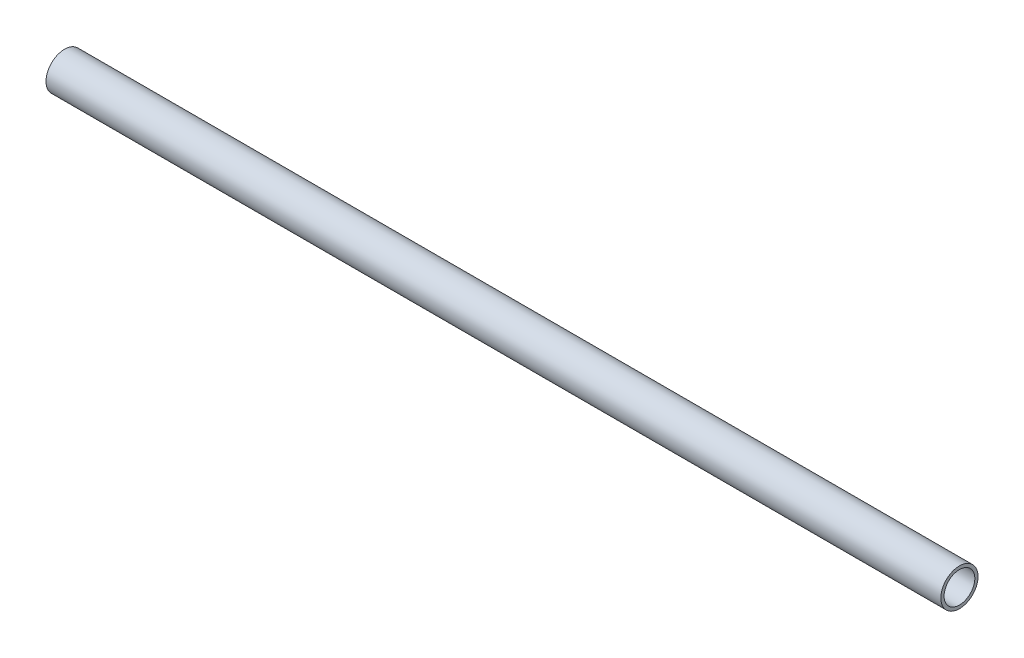
ISO-10303-21;
HEADER;
FILE_DESCRIPTION(('STEP AP214'),'2;1');
FILE_NAME('part.step','',(''),(''),'','','');
FILE_SCHEMA(('AUTOMOTIVE_DESIGN { 1 0 10303 214 1 1 1 1 }'));
ENDSEC;
DATA;
#1=APPLICATION_CONTEXT('core data for automotive mechanical design processes');
#2=APPLICATION_PROTOCOL_DEFINITION('international standard','automotive_design',2000,#1);
#3=PRODUCT_CONTEXT('',#1,'mechanical');
#4=PRODUCT('Part','Part','',(#3));
#5=PRODUCT_RELATED_PRODUCT_CATEGORY('part','',(#4));
#6=PRODUCT_DEFINITION_FORMATION('','',#4);
#7=PRODUCT_DEFINITION_CONTEXT('part definition',#1,'design');
#8=PRODUCT_DEFINITION('design','',#6,#7);
#9=PRODUCT_DEFINITION_SHAPE('','',#8);
#10=(LENGTH_UNIT() NAMED_UNIT(*) SI_UNIT(.MILLI.,.METRE.));
#11=(NAMED_UNIT(*) PLANE_ANGLE_UNIT() SI_UNIT($,.RADIAN.));
#12=(NAMED_UNIT(*) SI_UNIT($,.STERADIAN.) SOLID_ANGLE_UNIT());
#13=UNCERTAINTY_MEASURE_WITH_UNIT(LENGTH_MEASURE(1.E-05),#10,'distance_accuracy_value','');
#14=(GEOMETRIC_REPRESENTATION_CONTEXT(3) GLOBAL_UNCERTAINTY_ASSIGNED_CONTEXT((#13)) GLOBAL_UNIT_ASSIGNED_CONTEXT((#10,
#11,#12)) REPRESENTATION_CONTEXT('',''));
#15=CARTESIAN_POINT('',(0.,0.,0.));
#16=DIRECTION('',(0.,0.,1.));
#17=DIRECTION('',(1.,0.,0.));
#18=AXIS2_PLACEMENT_3D('',#15,#16,#17);
#19=CARTESIAN_POINT('',(228.600000000005,0.,0.));
#20=DIRECTION('',(1.,0.,0.));
#21=DIRECTION('',(0.,0.,-1.));
#22=AXIS2_PLACEMENT_3D('',#19,#20,#21);
#23=PLANE('',#22);
#24=CARTESIAN_POINT('',(228.600000000005,0.,0.));
#25=DIRECTION('',(-1.,0.,0.));
#26=DIRECTION('',(0.,0.,1.));
#27=AXIS2_PLACEMENT_3D('',#24,#25,#26);
#28=CIRCLE('',#27,7.84480177551919);
#29=CARTESIAN_POINT('',(228.600000000005,0.,7.84480177551919));
#30=VERTEX_POINT('',#29);
#31=EDGE_CURVE('E10',#30,#30,#28,.T.);
#32=ORIENTED_EDGE('',*,*,#31,.T.);
#33=EDGE_LOOP('',(#32));
#34=FACE_BOUND('',#33,.T.);
#35=CARTESIAN_POINT('',(228.600000000005,0.,0.));
#36=DIRECTION('',(-1.,0.,0.));
#37=DIRECTION('',(0.,0.,1.));
#38=AXIS2_PLACEMENT_3D('',#35,#36,#37);
#39=CIRCLE('',#38,9.49580177551919);
#40=CARTESIAN_POINT('',(228.600000000005,0.,9.49580177551919));
#41=VERTEX_POINT('',#40);
#42=EDGE_CURVE('E45',#41,#41,#39,.T.);
#43=ORIENTED_EDGE('',*,*,#42,.F.);
#44=EDGE_LOOP('',(#43));
#45=FACE_BOUND('',#44,.T.);
#46=ADVANCED_FACE('F31',(#34,#45),#23,.T.);
#47=CARTESIAN_POINT('',(-228.6,0.,0.));
#48=DIRECTION('',(-1.,0.,0.));
#49=DIRECTION('',(0.,0.,1.));
#50=AXIS2_PLACEMENT_3D('',#47,#48,#49);
#51=CYLINDRICAL_SURFACE('',#50,7.84480177551919);
#52=CARTESIAN_POINT('',(-228.599999999995,0.,0.));
#53=DIRECTION('',(-1.,0.,0.));
#54=DIRECTION('',(0.,0.,1.));
#55=AXIS2_PLACEMENT_3D('',#52,#53,#54);
#56=CIRCLE('',#55,7.84480177551919);
#57=CARTESIAN_POINT('',(-228.599999999995,0.,7.84480177551919));
#58=VERTEX_POINT('',#57);
#59=EDGE_CURVE('E37',#58,#58,#56,.T.);
#60=ORIENTED_EDGE('',*,*,#59,.T.);
#61=EDGE_LOOP('',(#60));
#62=FACE_BOUND('',#61,.T.);
#63=ORIENTED_EDGE('',*,*,#31,.F.);
#64=EDGE_LOOP('',(#63));
#65=FACE_BOUND('',#64,.T.);
#66=ADVANCED_FACE('F54',(#62,#65),#51,.F.);
#67=CARTESIAN_POINT('',(-228.599999999995,0.,1.33636416086323E-12));
#68=DIRECTION('',(1.,0.,0.));
#69=DIRECTION('',(0.,0.,-1.));
#70=AXIS2_PLACEMENT_3D('',#67,#68,#69);
#71=PLANE('',#70);
#72=ORIENTED_EDGE('',*,*,#59,.F.);
#73=EDGE_LOOP('',(#72));
#74=FACE_BOUND('',#73,.T.);
#75=CARTESIAN_POINT('',(-228.599999999995,0.,0.));
#76=DIRECTION('',(-1.,0.,0.));
#77=DIRECTION('',(0.,0.,1.));
#78=AXIS2_PLACEMENT_3D('',#75,#76,#77);
#79=CIRCLE('',#78,9.49580177551919);
#80=CARTESIAN_POINT('',(-228.599999999995,0.,9.49580177551919));
#81=VERTEX_POINT('',#80);
#82=EDGE_CURVE('E41',#81,#81,#79,.T.);
#83=ORIENTED_EDGE('',*,*,#82,.T.);
#84=EDGE_LOOP('',(#83));
#85=FACE_BOUND('',#84,.T.);
#86=ADVANCED_FACE('F58',(#74,#85),#71,.F.);
#87=CARTESIAN_POINT('',(-228.6,0.,0.));
#88=DIRECTION('',(-1.,0.,0.));
#89=DIRECTION('',(0.,0.,1.));
#90=AXIS2_PLACEMENT_3D('',#87,#88,#89);
#91=CYLINDRICAL_SURFACE('',#90,9.49580177551919);
#92=ORIENTED_EDGE('',*,*,#82,.F.);
#93=EDGE_LOOP('',(#92));
#94=FACE_BOUND('',#93,.T.);
#95=ORIENTED_EDGE('',*,*,#42,.T.);
#96=EDGE_LOOP('',(#95));
#97=FACE_BOUND('',#96,.T.);
#98=ADVANCED_FACE('F51',(#94,#97),#91,.T.);
#99=CLOSED_SHELL('',(#46,#66,#86,#98));
#100=MANIFOLD_SOLID_BREP('B2',#99);
#101=ADVANCED_BREP_SHAPE_REPRESENTATION('',(#18,#100),#14);
#102=SHAPE_DEFINITION_REPRESENTATION(#9,#101);
ENDSEC;
END-ISO-10303-21;
